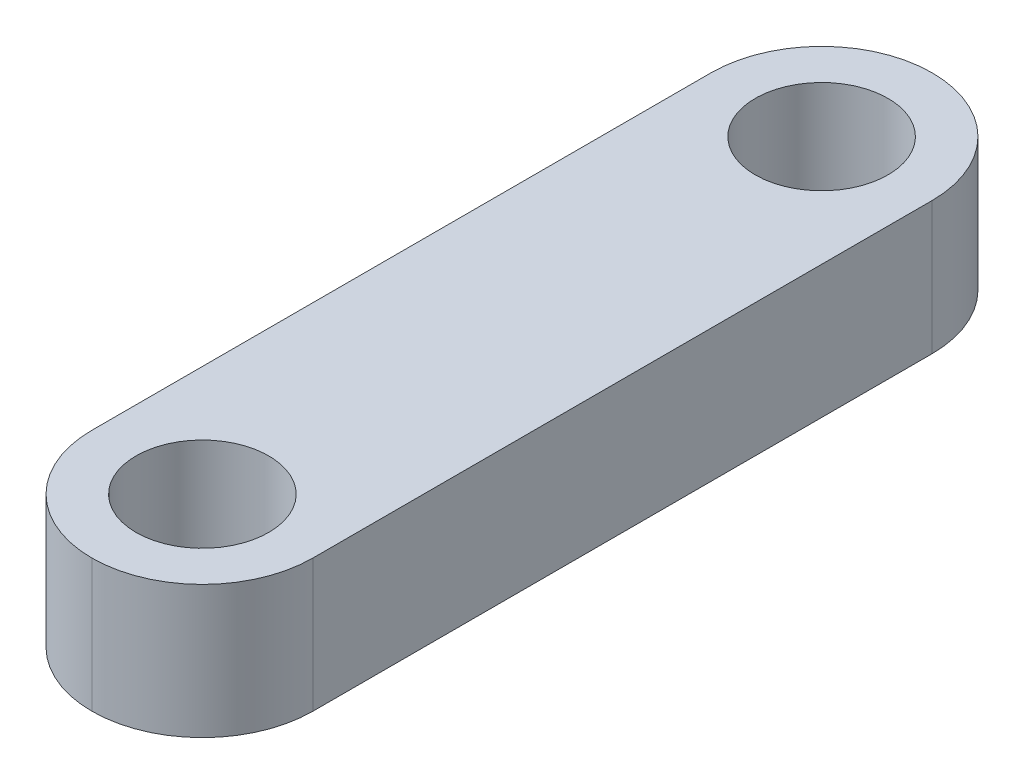
ISO-10303-21;
HEADER;
FILE_DESCRIPTION(('STEP AP214'),'2;1');
FILE_NAME('part.step','',(''),(''),'','','');
FILE_SCHEMA(('AUTOMOTIVE_DESIGN { 1 0 10303 214 1 1 1 1 }'));
ENDSEC;
DATA;
#1=APPLICATION_CONTEXT('core data for automotive mechanical design processes');
#2=APPLICATION_PROTOCOL_DEFINITION('international standard','automotive_design',2000,#1);
#3=PRODUCT_CONTEXT('',#1,'mechanical');
#4=PRODUCT('Part','Part','',(#3));
#5=PRODUCT_RELATED_PRODUCT_CATEGORY('part','',(#4));
#6=PRODUCT_DEFINITION_FORMATION('','',#4);
#7=PRODUCT_DEFINITION_CONTEXT('part definition',#1,'design');
#8=PRODUCT_DEFINITION('design','',#6,#7);
#9=PRODUCT_DEFINITION_SHAPE('','',#8);
#10=(LENGTH_UNIT() NAMED_UNIT(*) SI_UNIT(.MILLI.,.METRE.));
#11=(NAMED_UNIT(*) PLANE_ANGLE_UNIT() SI_UNIT($,.RADIAN.));
#12=(NAMED_UNIT(*) SI_UNIT($,.STERADIAN.) SOLID_ANGLE_UNIT());
#13=UNCERTAINTY_MEASURE_WITH_UNIT(LENGTH_MEASURE(1.E-05),#10,'distance_accuracy_value','');
#14=(GEOMETRIC_REPRESENTATION_CONTEXT(3) GLOBAL_UNCERTAINTY_ASSIGNED_CONTEXT((#13)) GLOBAL_UNIT_ASSIGNED_CONTEXT((#10,
#11,#12)) REPRESENTATION_CONTEXT('',''));
#15=CARTESIAN_POINT('',(0.,0.,0.));
#16=DIRECTION('',(0.,0.,1.));
#17=DIRECTION('',(1.,0.,0.));
#18=AXIS2_PLACEMENT_3D('',#15,#16,#17);
#19=CARTESIAN_POINT('',(0.,3.,0.));
#20=DIRECTION('',(0.,1.,0.));
#21=DIRECTION('',(0.,0.,1.));
#22=AXIS2_PLACEMENT_3D('',#19,#20,#21);
#23=PLANE('',#22);
#24=CARTESIAN_POINT('',(0.469658290187341,3.,5.34966647393243));
#25=DIRECTION('',(0.,1.,0.));
#26=DIRECTION('',(0.,0.,1.));
#27=AXIS2_PLACEMENT_3D('',#24,#25,#26);
#28=CIRCLE('',#27,1.5);
#29=CARTESIAN_POINT('',(0.469658290187341,3.,6.84966647393243));
#30=VERTEX_POINT('',#29);
#31=EDGE_CURVE('E107',#30,#30,#28,.T.);
#32=ORIENTED_EDGE('',*,*,#31,.F.);
#33=EDGE_LOOP('',(#32));
#34=FACE_BOUND('',#33,.T.);
#35=DIRECTION('',(0.,0.,-1.));
#36=VECTOR('',#35,1.);
#37=CARTESIAN_POINT('',(2.96965829018734,3.,-11.1503335260676));
#38=LINE('',#37,#36);
#39=CARTESIAN_POINT('',(2.96965829018734,3.,5.34966647393243));
#40=VERTEX_POINT('',#39);
#41=CARTESIAN_POINT('',(2.96965829018734,3.,-8.65033352606757));
#42=VERTEX_POINT('',#41);
#43=EDGE_CURVE('E143',#40,#42,#38,.T.);
#44=ORIENTED_EDGE('',*,*,#43,.T.);
#45=CARTESIAN_POINT('',(0.469658290187339,3.,-8.65033352606757));
#46=DIRECTION('',(0.,1.,0.));
#47=DIRECTION('',(0.,0.,1.));
#48=AXIS2_PLACEMENT_3D('',#45,#46,#47);
#49=CIRCLE('',#48,2.5);
#50=CARTESIAN_POINT('',(0.469658290187339,3.,-11.1503335260676));
#51=VERTEX_POINT('',#50);
#52=EDGE_CURVE('E54',#42,#51,#49,.T.);
#53=ORIENTED_EDGE('',*,*,#52,.T.);
#54=CARTESIAN_POINT('',(0.469658290187339,3.,-8.65033352606757));
#55=DIRECTION('',(0.,1.,0.));
#56=DIRECTION('',(0.,0.,1.));
#57=AXIS2_PLACEMENT_3D('',#54,#55,#56);
#58=CIRCLE('',#57,2.5);
#59=CARTESIAN_POINT('',(-2.03034170981266,3.,-8.65033352606757));
#60=VERTEX_POINT('',#59);
#61=EDGE_CURVE('E129',#51,#60,#58,.T.);
#62=ORIENTED_EDGE('',*,*,#61,.T.);
#63=DIRECTION('',(0.,0.,1.));
#64=VECTOR('',#63,1.);
#65=CARTESIAN_POINT('',(-2.03034170981266,3.,-11.1503335260676));
#66=LINE('',#65,#64);
#67=CARTESIAN_POINT('',(-2.03034170981266,3.,5.34966647393243));
#68=VERTEX_POINT('',#67);
#69=EDGE_CURVE('E96',#60,#68,#66,.T.);
#70=ORIENTED_EDGE('',*,*,#69,.T.);
#71=CARTESIAN_POINT('',(0.469658290187341,3.,5.34966647393243));
#72=DIRECTION('',(0.,1.,0.));
#73=DIRECTION('',(0.,0.,1.));
#74=AXIS2_PLACEMENT_3D('',#71,#72,#73);
#75=CIRCLE('',#74,2.5);
#76=CARTESIAN_POINT('',(0.469658290187341,3.,7.84966647393243));
#77=VERTEX_POINT('',#76);
#78=EDGE_CURVE('E61',#68,#77,#75,.T.);
#79=ORIENTED_EDGE('',*,*,#78,.T.);
#80=CARTESIAN_POINT('',(0.469658290187341,3.,5.34966647393243));
#81=DIRECTION('',(0.,1.,0.));
#82=DIRECTION('',(0.,0.,1.));
#83=AXIS2_PLACEMENT_3D('',#80,#81,#82);
#84=CIRCLE('',#83,2.5);
#85=EDGE_CURVE('E127',#77,#40,#84,.T.);
#86=ORIENTED_EDGE('',*,*,#85,.T.);
#87=EDGE_LOOP('',(#44,#53,#62,#70,#79,#86));
#88=FACE_BOUND('',#87,.T.);
#89=CARTESIAN_POINT('',(0.469658290187339,3.,-8.65033352606757));
#90=DIRECTION('',(0.,1.,0.));
#91=DIRECTION('',(0.,0.,1.));
#92=AXIS2_PLACEMENT_3D('',#89,#90,#91);
#93=CIRCLE('',#92,1.5);
#94=CARTESIAN_POINT('',(0.469658290187339,3.,-7.15033352606757));
#95=VERTEX_POINT('',#94);
#96=EDGE_CURVE('E135',#95,#95,#93,.T.);
#97=ORIENTED_EDGE('',*,*,#96,.F.);
#98=EDGE_LOOP('',(#97));
#99=FACE_BOUND('',#98,.T.);
#100=ADVANCED_FACE('F37',(#34,#88,#99),#23,.T.);
#101=CARTESIAN_POINT('',(0.,0.,0.));
#102=DIRECTION('',(0.,1.,0.));
#103=DIRECTION('',(0.,0.,1.));
#104=AXIS2_PLACEMENT_3D('',#101,#102,#103);
#105=PLANE('',#104);
#106=CARTESIAN_POINT('',(0.469658290187339,0.,-8.65033352606757));
#107=DIRECTION('',(0.,1.,0.));
#108=DIRECTION('',(0.,0.,1.));
#109=AXIS2_PLACEMENT_3D('',#106,#107,#108);
#110=CIRCLE('',#109,2.5);
#111=CARTESIAN_POINT('',(-2.03034170981266,0.,-8.65033352606757));
#112=VERTEX_POINT('',#111);
#113=CARTESIAN_POINT('',(0.469658290187339,0.,-11.1503335260676));
#114=VERTEX_POINT('',#113);
#115=EDGE_CURVE('E102',#112,#114,#110,.F.);
#116=ORIENTED_EDGE('',*,*,#115,.T.);
#117=CARTESIAN_POINT('',(0.469658290187339,0.,-8.65033352606757));
#118=DIRECTION('',(0.,1.,0.));
#119=DIRECTION('',(0.,0.,1.));
#120=AXIS2_PLACEMENT_3D('',#117,#118,#119);
#121=CIRCLE('',#120,2.5);
#122=CARTESIAN_POINT('',(2.96965829018734,0.,-8.65033352606757));
#123=VERTEX_POINT('',#122);
#124=EDGE_CURVE('E113',#114,#123,#121,.F.);
#125=ORIENTED_EDGE('',*,*,#124,.T.);
#126=DIRECTION('',(0.,0.,-1.));
#127=VECTOR('',#126,1.);
#128=CARTESIAN_POINT('',(2.96965829018734,0.,-11.1503335260676));
#129=LINE('',#128,#127);
#130=CARTESIAN_POINT('',(2.96965829018734,0.,5.34966647393243));
#131=VERTEX_POINT('',#130);
#132=EDGE_CURVE('E106',#131,#123,#129,.T.);
#133=ORIENTED_EDGE('',*,*,#132,.F.);
#134=CARTESIAN_POINT('',(0.469658290187341,0.,5.34966647393243));
#135=DIRECTION('',(0.,1.,0.));
#136=DIRECTION('',(0.,0.,1.));
#137=AXIS2_PLACEMENT_3D('',#134,#135,#136);
#138=CIRCLE('',#137,2.5);
#139=CARTESIAN_POINT('',(0.469658290187341,0.,7.84966647393243));
#140=VERTEX_POINT('',#139);
#141=EDGE_CURVE('E114',#131,#140,#138,.F.);
#142=ORIENTED_EDGE('',*,*,#141,.T.);
#143=CARTESIAN_POINT('',(0.469658290187341,0.,5.34966647393243));
#144=DIRECTION('',(0.,1.,0.));
#145=DIRECTION('',(0.,0.,1.));
#146=AXIS2_PLACEMENT_3D('',#143,#144,#145);
#147=CIRCLE('',#146,2.5);
#148=CARTESIAN_POINT('',(-2.03034170981266,0.,5.34966647393243));
#149=VERTEX_POINT('',#148);
#150=EDGE_CURVE('E105',#140,#149,#147,.F.);
#151=ORIENTED_EDGE('',*,*,#150,.T.);
#152=DIRECTION('',(0.,0.,1.));
#153=VECTOR('',#152,1.);
#154=CARTESIAN_POINT('',(-2.03034170981266,0.,-11.1503335260676));
#155=LINE('',#154,#153);
#156=EDGE_CURVE('E94',#112,#149,#155,.T.);
#157=ORIENTED_EDGE('',*,*,#156,.F.);
#158=EDGE_LOOP('',(#116,#125,#133,#142,#151,#157));
#159=FACE_BOUND('',#158,.T.);
#160=CARTESIAN_POINT('',(0.469658290187341,0.,5.34966647393243));
#161=DIRECTION('',(0.,1.,0.));
#162=DIRECTION('',(0.,0.,1.));
#163=AXIS2_PLACEMENT_3D('',#160,#161,#162);
#164=CIRCLE('',#163,1.5);
#165=CARTESIAN_POINT('',(0.469658290187341,0.,6.84966647393243));
#166=VERTEX_POINT('',#165);
#167=EDGE_CURVE('E149',#166,#166,#164,.T.);
#168=ORIENTED_EDGE('',*,*,#167,.T.);
#169=EDGE_LOOP('',(#168));
#170=FACE_BOUND('',#169,.T.);
#171=CARTESIAN_POINT('',(0.469658290187339,0.,-8.65033352606757));
#172=DIRECTION('',(0.,1.,0.));
#173=DIRECTION('',(0.,0.,1.));
#174=AXIS2_PLACEMENT_3D('',#171,#172,#173);
#175=CIRCLE('',#174,1.5);
#176=CARTESIAN_POINT('',(0.469658290187339,0.,-7.15033352606757));
#177=VERTEX_POINT('',#176);
#178=EDGE_CURVE('E132',#177,#177,#175,.T.);
#179=ORIENTED_EDGE('',*,*,#178,.T.);
#180=EDGE_LOOP('',(#179));
#181=FACE_BOUND('',#180,.T.);
#182=ADVANCED_FACE('F100',(#159,#170,#181),#105,.F.);
#183=CARTESIAN_POINT('',(-2.03034170981266,3.,-11.1503335260676));
#184=DIRECTION('',(1.,0.,0.));
#185=DIRECTION('',(0.,0.,-1.));
#186=AXIS2_PLACEMENT_3D('',#183,#184,#185);
#187=PLANE('',#186);
#188=ORIENTED_EDGE('',*,*,#69,.F.);
#189=DIRECTION('',(0.,-1.,0.));
#190=VECTOR('',#189,1.);
#191=CARTESIAN_POINT('',(-2.03034170981266,3.,-8.65033352606757));
#192=LINE('',#191,#190);
#193=EDGE_CURVE('E11',#60,#112,#192,.T.);
#194=ORIENTED_EDGE('',*,*,#193,.T.);
#195=ORIENTED_EDGE('',*,*,#156,.T.);
#196=DIRECTION('',(0.,-1.,0.));
#197=VECTOR('',#196,1.);
#198=CARTESIAN_POINT('',(-2.03034170981266,3.,5.34966647393243));
#199=LINE('',#198,#197);
#200=EDGE_CURVE('E46',#149,#68,#199,.F.);
#201=ORIENTED_EDGE('',*,*,#200,.T.);
#202=EDGE_LOOP('',(#188,#194,#195,#201));
#203=FACE_BOUND('',#202,.T.);
#204=ADVANCED_FACE('F93',(#203),#187,.F.);
#205=CARTESIAN_POINT('',(2.96965829018734,3.,-11.1503335260676));
#206=DIRECTION('',(-1.,0.,0.));
#207=DIRECTION('',(0.,0.,1.));
#208=AXIS2_PLACEMENT_3D('',#205,#206,#207);
#209=PLANE('',#208);
#210=ORIENTED_EDGE('',*,*,#132,.T.);
#211=DIRECTION('',(0.,-1.,0.));
#212=VECTOR('',#211,1.);
#213=CARTESIAN_POINT('',(2.96965829018734,3.,-8.65033352606757));
#214=LINE('',#213,#212);
#215=EDGE_CURVE('E123',#123,#42,#214,.F.);
#216=ORIENTED_EDGE('',*,*,#215,.T.);
#217=ORIENTED_EDGE('',*,*,#43,.F.);
#218=DIRECTION('',(0.,-1.,0.));
#219=VECTOR('',#218,1.);
#220=CARTESIAN_POINT('',(2.96965829018734,3.,5.34966647393243));
#221=LINE('',#220,#219);
#222=EDGE_CURVE('E116',#40,#131,#221,.T.);
#223=ORIENTED_EDGE('',*,*,#222,.T.);
#224=EDGE_LOOP('',(#210,#216,#217,#223));
#225=FACE_BOUND('',#224,.T.);
#226=ADVANCED_FACE('F172',(#225),#209,.F.);
#227=CARTESIAN_POINT('',(0.469658290187341,3.,5.34966647393243));
#228=DIRECTION('',(0.,-1.,0.));
#229=DIRECTION('',(0.,0.,-1.));
#230=AXIS2_PLACEMENT_3D('',#227,#228,#229);
#231=CYLINDRICAL_SURFACE('',#230,1.5);
#232=ORIENTED_EDGE('',*,*,#31,.T.);
#233=EDGE_LOOP('',(#232));
#234=FACE_BOUND('',#233,.T.);
#235=ORIENTED_EDGE('',*,*,#167,.F.);
#236=EDGE_LOOP('',(#235));
#237=FACE_BOUND('',#236,.T.);
#238=ADVANCED_FACE('F169',(#234,#237),#231,.F.);
#239=CARTESIAN_POINT('',(0.469658290187339,3.,-8.65033352606757));
#240=DIRECTION('',(0.,-1.,0.));
#241=DIRECTION('',(0.,0.,-1.));
#242=AXIS2_PLACEMENT_3D('',#239,#240,#241);
#243=CYLINDRICAL_SURFACE('',#242,1.5);
#244=ORIENTED_EDGE('',*,*,#96,.T.);
#245=EDGE_LOOP('',(#244));
#246=FACE_BOUND('',#245,.T.);
#247=ORIENTED_EDGE('',*,*,#178,.F.);
#248=EDGE_LOOP('',(#247));
#249=FACE_BOUND('',#248,.T.);
#250=ADVANCED_FACE('F157',(#246,#249),#243,.F.);
#251=CARTESIAN_POINT('',(0.469658290187339,3.,-8.65033352606757));
#252=DIRECTION('',(0.,-1.,0.));
#253=DIRECTION('',(0.,0.,-1.));
#254=AXIS2_PLACEMENT_3D('',#251,#252,#253);
#255=CYLINDRICAL_SURFACE('',#254,2.5);
#256=ORIENTED_EDGE('',*,*,#193,.F.);
#257=ORIENTED_EDGE('',*,*,#61,.F.);
#258=DIRECTION('',(0.,-1.,0.));
#259=VECTOR('',#258,1.);
#260=CARTESIAN_POINT('',(0.469658290187339,3.,-11.1503335260676));
#261=LINE('',#260,#259);
#262=EDGE_CURVE('E111',#114,#51,#261,.F.);
#263=ORIENTED_EDGE('',*,*,#262,.F.);
#264=ORIENTED_EDGE('',*,*,#115,.F.);
#265=EDGE_LOOP('',(#256,#257,#263,#264));
#266=FACE_BOUND('',#265,.T.);
#267=ADVANCED_FACE('F109',(#266),#255,.T.);
#268=CARTESIAN_POINT('',(0.469658290187339,3.,-8.65033352606757));
#269=DIRECTION('',(0.,-1.,0.));
#270=DIRECTION('',(0.,0.,-1.));
#271=AXIS2_PLACEMENT_3D('',#268,#269,#270);
#272=CYLINDRICAL_SURFACE('',#271,2.5);
#273=ORIENTED_EDGE('',*,*,#52,.F.);
#274=ORIENTED_EDGE('',*,*,#215,.F.);
#275=ORIENTED_EDGE('',*,*,#124,.F.);
#276=ORIENTED_EDGE('',*,*,#262,.T.);
#277=EDGE_LOOP('',(#273,#274,#275,#276));
#278=FACE_BOUND('',#277,.T.);
#279=ADVANCED_FACE('F178',(#278),#272,.T.);
#280=CARTESIAN_POINT('',(0.469658290187341,3.,5.34966647393243));
#281=DIRECTION('',(0.,-1.,0.));
#282=DIRECTION('',(0.,0.,-1.));
#283=AXIS2_PLACEMENT_3D('',#280,#281,#282);
#284=CYLINDRICAL_SURFACE('',#283,2.5);
#285=DIRECTION('',(0.,-1.,0.));
#286=VECTOR('',#285,1.);
#287=CARTESIAN_POINT('',(0.469658290187341,3.,7.84966647393243));
#288=LINE('',#287,#286);
#289=EDGE_CURVE('E41',#77,#140,#288,.T.);
#290=ORIENTED_EDGE('',*,*,#289,.F.);
#291=ORIENTED_EDGE('',*,*,#78,.F.);
#292=ORIENTED_EDGE('',*,*,#200,.F.);
#293=ORIENTED_EDGE('',*,*,#150,.F.);
#294=EDGE_LOOP('',(#290,#291,#292,#293));
#295=FACE_BOUND('',#294,.T.);
#296=ADVANCED_FACE('F39',(#295),#284,.T.);
#297=CARTESIAN_POINT('',(0.469658290187341,3.,5.34966647393243));
#298=DIRECTION('',(0.,-1.,0.));
#299=DIRECTION('',(0.,0.,-1.));
#300=AXIS2_PLACEMENT_3D('',#297,#298,#299);
#301=CYLINDRICAL_SURFACE('',#300,2.5);
#302=ORIENTED_EDGE('',*,*,#85,.F.);
#303=ORIENTED_EDGE('',*,*,#289,.T.);
#304=ORIENTED_EDGE('',*,*,#141,.F.);
#305=ORIENTED_EDGE('',*,*,#222,.F.);
#306=EDGE_LOOP('',(#302,#303,#304,#305));
#307=FACE_BOUND('',#306,.T.);
#308=ADVANCED_FACE('F140',(#307),#301,.T.);
#309=CLOSED_SHELL('',(#100,#182,#204,#226,#238,#250,#267,#279,#296,#308));
#310=MANIFOLD_SOLID_BREP('B2',#309);
#311=ADVANCED_BREP_SHAPE_REPRESENTATION('',(#18,#310),#14);
#312=SHAPE_DEFINITION_REPRESENTATION(#9,#311);
ENDSEC;
END-ISO-10303-21;
